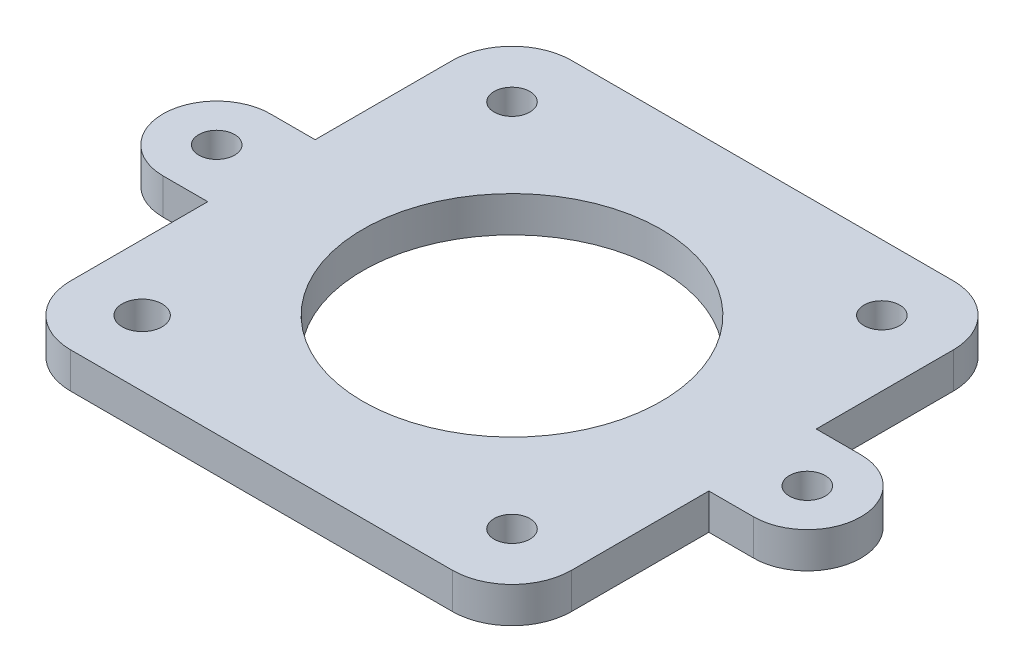
ISO-10303-21;
HEADER;
FILE_DESCRIPTION(('STEP AP214'),'2;1');
FILE_NAME('part.step','',(''),(''),'','','');
FILE_SCHEMA(('AUTOMOTIVE_DESIGN { 1 0 10303 214 1 1 1 1 }'));
ENDSEC;
DATA;
#1=APPLICATION_CONTEXT('core data for automotive mechanical design processes');
#2=APPLICATION_PROTOCOL_DEFINITION('international standard','automotive_design',2000,#1);
#3=PRODUCT_CONTEXT('',#1,'mechanical');
#4=PRODUCT('Part','Part','',(#3));
#5=PRODUCT_RELATED_PRODUCT_CATEGORY('part','',(#4));
#6=PRODUCT_DEFINITION_FORMATION('','',#4);
#7=PRODUCT_DEFINITION_CONTEXT('part definition',#1,'design');
#8=PRODUCT_DEFINITION('design','',#6,#7);
#9=PRODUCT_DEFINITION_SHAPE('','',#8);
#10=(LENGTH_UNIT() NAMED_UNIT(*) SI_UNIT(.MILLI.,.METRE.));
#11=(NAMED_UNIT(*) PLANE_ANGLE_UNIT() SI_UNIT($,.RADIAN.));
#12=(NAMED_UNIT(*) SI_UNIT($,.STERADIAN.) SOLID_ANGLE_UNIT());
#13=UNCERTAINTY_MEASURE_WITH_UNIT(LENGTH_MEASURE(1.E-05),#10,'distance_accuracy_value','');
#14=(GEOMETRIC_REPRESENTATION_CONTEXT(3) GLOBAL_UNCERTAINTY_ASSIGNED_CONTEXT((#13)) GLOBAL_UNIT_ASSIGNED_CONTEXT((#10,
#11,#12)) REPRESENTATION_CONTEXT('',''));
#15=CARTESIAN_POINT('',(0.,0.,0.));
#16=DIRECTION('',(0.,0.,1.));
#17=DIRECTION('',(1.,0.,0.));
#18=AXIS2_PLACEMENT_3D('',#15,#16,#17);
#19=CARTESIAN_POINT('',(21.,3.,16.));
#20=DIRECTION('',(-1.,0.,0.));
#21=DIRECTION('',(0.,0.,1.));
#22=AXIS2_PLACEMENT_3D('',#19,#20,#21);
#23=PLANE('',#22);
#24=DIRECTION('',(0.,0.,-1.));
#25=VECTOR('',#24,1.);
#26=CARTESIAN_POINT('',(21.,0.,16.));
#27=LINE('',#26,#25);
#28=CARTESIAN_POINT('',(21.,0.,16.));
#29=VERTEX_POINT('',#28);
#30=CARTESIAN_POINT('',(21.,0.,4.5));
#31=VERTEX_POINT('',#30);
#32=EDGE_CURVE('E277',#29,#31,#27,.T.);
#33=ORIENTED_EDGE('',*,*,#32,.T.);
#34=DIRECTION('',(0.,1.,0.));
#35=VECTOR('',#34,1.);
#36=CARTESIAN_POINT('',(21.,0.,4.5));
#37=LINE('',#36,#35);
#38=CARTESIAN_POINT('',(21.,3.,4.5));
#39=VERTEX_POINT('',#38);
#40=EDGE_CURVE('E185',#31,#39,#37,.T.);
#41=ORIENTED_EDGE('',*,*,#40,.T.);
#42=DIRECTION('',(0.,0.,-1.));
#43=VECTOR('',#42,1.);
#44=CARTESIAN_POINT('',(21.,3.,16.));
#45=LINE('',#44,#43);
#46=CARTESIAN_POINT('',(21.,3.,16.));
#47=VERTEX_POINT('',#46);
#48=EDGE_CURVE('E257',#47,#39,#45,.T.);
#49=ORIENTED_EDGE('',*,*,#48,.F.);
#50=DIRECTION('',(0.,-1.,0.));
#51=VECTOR('',#50,1.);
#52=CARTESIAN_POINT('',(21.,3.,16.));
#53=LINE('',#52,#51);
#54=EDGE_CURVE('E303',#47,#29,#53,.T.);
#55=ORIENTED_EDGE('',*,*,#54,.T.);
#56=EDGE_LOOP('',(#33,#41,#49,#55));
#57=FACE_BOUND('',#56,.T.);
#58=ADVANCED_FACE('F33',(#57),#23,.F.);
#59=CARTESIAN_POINT('',(-21.,3.,16.));
#60=DIRECTION('',(1.,0.,0.));
#61=DIRECTION('',(0.,0.,-1.));
#62=AXIS2_PLACEMENT_3D('',#59,#60,#61);
#63=PLANE('',#62);
#64=DIRECTION('',(0.,0.,1.));
#65=VECTOR('',#64,1.);
#66=CARTESIAN_POINT('',(-21.,0.,16.));
#67=LINE('',#66,#65);
#68=CARTESIAN_POINT('',(-21.,0.,-16.));
#69=VERTEX_POINT('',#68);
#70=CARTESIAN_POINT('',(-21.,0.,-4.5));
#71=VERTEX_POINT('',#70);
#72=EDGE_CURVE('E252',#69,#71,#67,.T.);
#73=ORIENTED_EDGE('',*,*,#72,.T.);
#74=DIRECTION('',(0.,1.,0.));
#75=VECTOR('',#74,1.);
#76=CARTESIAN_POINT('',(-21.,0.,-4.5));
#77=LINE('',#76,#75);
#78=CARTESIAN_POINT('',(-21.,3.,-4.5));
#79=VERTEX_POINT('',#78);
#80=EDGE_CURVE('E212',#71,#79,#77,.T.);
#81=ORIENTED_EDGE('',*,*,#80,.T.);
#82=DIRECTION('',(0.,0.,1.));
#83=VECTOR('',#82,1.);
#84=CARTESIAN_POINT('',(-21.,3.,16.));
#85=LINE('',#84,#83);
#86=CARTESIAN_POINT('',(-21.,3.,-16.));
#87=VERTEX_POINT('',#86);
#88=EDGE_CURVE('E267',#87,#79,#85,.T.);
#89=ORIENTED_EDGE('',*,*,#88,.F.);
#90=DIRECTION('',(0.,-1.,0.));
#91=VECTOR('',#90,1.);
#92=CARTESIAN_POINT('',(-21.,3.,-16.));
#93=LINE('',#92,#91);
#94=EDGE_CURVE('E291',#87,#69,#93,.T.);
#95=ORIENTED_EDGE('',*,*,#94,.T.);
#96=EDGE_LOOP('',(#73,#81,#89,#95));
#97=FACE_BOUND('',#96,.T.);
#98=ADVANCED_FACE('F341',(#97),#63,.F.);
#99=CARTESIAN_POINT('',(-16.,3.,16.));
#100=DIRECTION('',(0.,-1.,0.));
#101=DIRECTION('',(0.,0.,-1.));
#102=AXIS2_PLACEMENT_3D('',#99,#100,#101);
#103=PLANE('',#102);
#104=CARTESIAN_POINT('',(0.,3.,0.));
#105=DIRECTION('',(0.,1.,0.));
#106=DIRECTION('',(0.,0.,1.));
#107=AXIS2_PLACEMENT_3D('',#104,#105,#106);
#108=CIRCLE('',#107,12.5);
#109=CARTESIAN_POINT('',(0.,3.,12.5));
#110=VERTEX_POINT('',#109);
#111=EDGE_CURVE('E211',#110,#110,#108,.T.);
#112=ORIENTED_EDGE('',*,*,#111,.F.);
#113=EDGE_LOOP('',(#112));
#114=FACE_BOUND('',#113,.T.);
#115=CARTESIAN_POINT('',(-15.5,3.,-15.5));
#116=DIRECTION('',(0.,1.,0.));
#117=DIRECTION('',(0.,0.,1.));
#118=AXIS2_PLACEMENT_3D('',#115,#116,#117);
#119=CIRCLE('',#118,1.5);
#120=CARTESIAN_POINT('',(-15.5,3.,-14.));
#121=VERTEX_POINT('',#120);
#122=EDGE_CURVE('E230',#121,#121,#119,.T.);
#123=ORIENTED_EDGE('',*,*,#122,.F.);
#124=EDGE_LOOP('',(#123));
#125=FACE_BOUND('',#124,.T.);
#126=CARTESIAN_POINT('',(15.5,3.,-15.5));
#127=DIRECTION('',(0.,1.,0.));
#128=DIRECTION('',(0.,0.,1.));
#129=AXIS2_PLACEMENT_3D('',#126,#127,#128);
#130=CIRCLE('',#129,1.5);
#131=CARTESIAN_POINT('',(15.5,3.,-14.));
#132=VERTEX_POINT('',#131);
#133=EDGE_CURVE('E242',#132,#132,#130,.T.);
#134=ORIENTED_EDGE('',*,*,#133,.F.);
#135=EDGE_LOOP('',(#134));
#136=FACE_BOUND('',#135,.T.);
#137=CARTESIAN_POINT('',(-16.,3.,16.));
#138=DIRECTION('',(0.,1.,0.));
#139=DIRECTION('',(0.,0.,-1.));
#140=AXIS2_PLACEMENT_3D('',#137,#138,#139);
#141=CIRCLE('',#140,5.);
#142=CARTESIAN_POINT('',(-21.,3.,16.));
#143=VERTEX_POINT('',#142);
#144=CARTESIAN_POINT('',(-16.,3.,21.));
#145=VERTEX_POINT('',#144);
#146=EDGE_CURVE('E248',#143,#145,#141,.T.);
#147=ORIENTED_EDGE('',*,*,#146,.T.);
#148=DIRECTION('',(1.,0.,0.));
#149=VECTOR('',#148,1.);
#150=CARTESIAN_POINT('',(-16.,3.,21.));
#151=LINE('',#150,#149);
#152=CARTESIAN_POINT('',(16.,3.,21.));
#153=VERTEX_POINT('',#152);
#154=EDGE_CURVE('E251',#145,#153,#151,.T.);
#155=ORIENTED_EDGE('',*,*,#154,.T.);
#156=CARTESIAN_POINT('',(16.,3.,16.));
#157=DIRECTION('',(0.,1.,0.));
#158=DIRECTION('',(0.,0.,1.));
#159=AXIS2_PLACEMENT_3D('',#156,#157,#158);
#160=CIRCLE('',#159,5.);
#161=EDGE_CURVE('E254',#153,#47,#160,.T.);
#162=ORIENTED_EDGE('',*,*,#161,.T.);
#163=ORIENTED_EDGE('',*,*,#48,.T.);
#164=DIRECTION('',(1.,0.,0.));
#165=VECTOR('',#164,1.);
#166=CARTESIAN_POINT('',(24.75,3.,4.5));
#167=LINE('',#166,#165);
#168=CARTESIAN_POINT('',(24.75,3.,4.5));
#169=VERTEX_POINT('',#168);
#170=EDGE_CURVE('E170',#39,#169,#167,.T.);
#171=ORIENTED_EDGE('',*,*,#170,.T.);
#172=CARTESIAN_POINT('',(24.75,3.,0.));
#173=DIRECTION('',(0.,1.,0.));
#174=DIRECTION('',(0.,0.,1.));
#175=AXIS2_PLACEMENT_3D('',#172,#173,#174);
#176=CIRCLE('',#175,4.5);
#177=CARTESIAN_POINT('',(24.75,3.,-4.5));
#178=VERTEX_POINT('',#177);
#179=EDGE_CURVE('E179',#169,#178,#176,.T.);
#180=ORIENTED_EDGE('',*,*,#179,.T.);
#181=DIRECTION('',(-1.,0.,0.));
#182=VECTOR('',#181,1.);
#183=CARTESIAN_POINT('',(24.75,3.,-4.5));
#184=LINE('',#183,#182);
#185=CARTESIAN_POINT('',(21.,3.,-4.5));
#186=VERTEX_POINT('',#185);
#187=EDGE_CURVE('E48',#178,#186,#184,.T.);
#188=ORIENTED_EDGE('',*,*,#187,.T.);
#189=CARTESIAN_POINT('',(21.,3.,-16.));
#190=VERTEX_POINT('',#189);
#191=EDGE_CURVE('E256',#186,#190,#45,.T.);
#192=ORIENTED_EDGE('',*,*,#191,.T.);
#193=CARTESIAN_POINT('',(16.,3.,-16.));
#194=DIRECTION('',(0.,1.,0.));
#195=DIRECTION('',(0.,0.,-1.));
#196=AXIS2_PLACEMENT_3D('',#193,#194,#195);
#197=CIRCLE('',#196,5.);
#198=CARTESIAN_POINT('',(16.,3.,-21.));
#199=VERTEX_POINT('',#198);
#200=EDGE_CURVE('E260',#190,#199,#197,.T.);
#201=ORIENTED_EDGE('',*,*,#200,.T.);
#202=DIRECTION('',(-1.,0.,0.));
#203=VECTOR('',#202,1.);
#204=CARTESIAN_POINT('',(-16.,3.,-21.));
#205=LINE('',#204,#203);
#206=CARTESIAN_POINT('',(-16.,3.,-21.));
#207=VERTEX_POINT('',#206);
#208=EDGE_CURVE('E262',#199,#207,#205,.T.);
#209=ORIENTED_EDGE('',*,*,#208,.T.);
#210=CARTESIAN_POINT('',(-16.,3.,-16.));
#211=DIRECTION('',(0.,1.,0.));
#212=DIRECTION('',(0.,0.,-1.));
#213=AXIS2_PLACEMENT_3D('',#210,#211,#212);
#214=CIRCLE('',#213,5.);
#215=EDGE_CURVE('E264',#207,#87,#214,.T.);
#216=ORIENTED_EDGE('',*,*,#215,.T.);
#217=ORIENTED_EDGE('',*,*,#88,.T.);
#218=DIRECTION('',(-1.,0.,0.));
#219=VECTOR('',#218,1.);
#220=CARTESIAN_POINT('',(-24.75,3.,-4.5));
#221=LINE('',#220,#219);
#222=CARTESIAN_POINT('',(-24.75,3.,-4.5));
#223=VERTEX_POINT('',#222);
#224=EDGE_CURVE('E199',#79,#223,#221,.T.);
#225=ORIENTED_EDGE('',*,*,#224,.T.);
#226=CARTESIAN_POINT('',(-24.75,3.,0.));
#227=DIRECTION('',(0.,1.,0.));
#228=DIRECTION('',(0.,0.,1.));
#229=AXIS2_PLACEMENT_3D('',#226,#227,#228);
#230=CIRCLE('',#229,4.5);
#231=CARTESIAN_POINT('',(-24.75,3.,4.5));
#232=VERTEX_POINT('',#231);
#233=EDGE_CURVE('E192',#223,#232,#230,.T.);
#234=ORIENTED_EDGE('',*,*,#233,.T.);
#235=DIRECTION('',(1.,0.,0.));
#236=VECTOR('',#235,1.);
#237=CARTESIAN_POINT('',(-24.75,3.,4.5));
#238=LINE('',#237,#236);
#239=CARTESIAN_POINT('',(-21.,3.,4.5));
#240=VERTEX_POINT('',#239);
#241=EDGE_CURVE('E55',#232,#240,#238,.T.);
#242=ORIENTED_EDGE('',*,*,#241,.T.);
#243=EDGE_CURVE('E266',#240,#143,#85,.T.);
#244=ORIENTED_EDGE('',*,*,#243,.T.);
#245=EDGE_LOOP('',(#147,#155,#162,#163,#171,#180,#188,#192,#201,#209,#216,#217,#225,#234,#242,#244));
#246=FACE_BOUND('',#245,.T.);
#247=CARTESIAN_POINT('',(15.5,3.,15.5));
#248=DIRECTION('',(0.,1.,0.));
#249=DIRECTION('',(0.,0.,1.));
#250=AXIS2_PLACEMENT_3D('',#247,#248,#249);
#251=CIRCLE('',#250,1.5);
#252=CARTESIAN_POINT('',(15.5,3.,17.));
#253=VERTEX_POINT('',#252);
#254=EDGE_CURVE('E236',#253,#253,#251,.T.);
#255=ORIENTED_EDGE('',*,*,#254,.F.);
#256=EDGE_LOOP('',(#255));
#257=FACE_BOUND('',#256,.T.);
#258=CARTESIAN_POINT('',(-15.5,3.,15.5));
#259=DIRECTION('',(0.,1.,0.));
#260=DIRECTION('',(0.,0.,1.));
#261=AXIS2_PLACEMENT_3D('',#258,#259,#260);
#262=CIRCLE('',#261,1.67292592504423);
#263=CARTESIAN_POINT('',(-15.5,3.,17.1729259250442));
#264=VERTEX_POINT('',#263);
#265=EDGE_CURVE('E224',#264,#264,#262,.T.);
#266=ORIENTED_EDGE('',*,*,#265,.F.);
#267=EDGE_LOOP('',(#266));
#268=FACE_BOUND('',#267,.T.);
#269=CARTESIAN_POINT('',(-24.75,3.,0.));
#270=DIRECTION('',(0.,1.,0.));
#271=DIRECTION('',(0.,0.,1.));
#272=AXIS2_PLACEMENT_3D('',#269,#270,#271);
#273=CIRCLE('',#272,1.5);
#274=CARTESIAN_POINT('',(-24.75,3.,1.5));
#275=VERTEX_POINT('',#274);
#276=EDGE_CURVE('E184',#275,#275,#273,.T.);
#277=ORIENTED_EDGE('',*,*,#276,.F.);
#278=EDGE_LOOP('',(#277));
#279=FACE_BOUND('',#278,.T.);
#280=CARTESIAN_POINT('',(24.75,3.,0.));
#281=DIRECTION('',(0.,1.,0.));
#282=DIRECTION('',(0.,0.,1.));
#283=AXIS2_PLACEMENT_3D('',#280,#281,#282);
#284=CIRCLE('',#283,1.5);
#285=CARTESIAN_POINT('',(24.75,3.,1.5));
#286=VERTEX_POINT('',#285);
#287=EDGE_CURVE('E175',#286,#286,#284,.T.);
#288=ORIENTED_EDGE('',*,*,#287,.F.);
#289=EDGE_LOOP('',(#288));
#290=FACE_BOUND('',#289,.T.);
#291=ADVANCED_FACE('F316',(#114,#125,#136,#246,#257,#268,#279,#290),#103,.F.);
#292=CARTESIAN_POINT('',(-16.,0.,16.));
#293=DIRECTION('',(0.,-1.,0.));
#294=DIRECTION('',(0.,0.,-1.));
#295=AXIS2_PLACEMENT_3D('',#292,#293,#294);
#296=PLANE('',#295);
#297=CARTESIAN_POINT('',(0.,0.,0.));
#298=DIRECTION('',(0.,1.,0.));
#299=DIRECTION('',(0.,0.,1.));
#300=AXIS2_PLACEMENT_3D('',#297,#298,#299);
#301=CIRCLE('',#300,12.5);
#302=CARTESIAN_POINT('',(0.,0.,12.5));
#303=VERTEX_POINT('',#302);
#304=EDGE_CURVE('E218',#303,#303,#301,.T.);
#305=ORIENTED_EDGE('',*,*,#304,.T.);
#306=EDGE_LOOP('',(#305));
#307=FACE_BOUND('',#306,.T.);
#308=CARTESIAN_POINT('',(-15.5,0.,-15.5));
#309=DIRECTION('',(0.,1.,0.));
#310=DIRECTION('',(0.,0.,1.));
#311=AXIS2_PLACEMENT_3D('',#308,#309,#310);
#312=CIRCLE('',#311,1.5);
#313=CARTESIAN_POINT('',(-15.5,0.,-14.));
#314=VERTEX_POINT('',#313);
#315=EDGE_CURVE('E227',#314,#314,#312,.T.);
#316=ORIENTED_EDGE('',*,*,#315,.T.);
#317=EDGE_LOOP('',(#316));
#318=FACE_BOUND('',#317,.T.);
#319=CARTESIAN_POINT('',(15.5,0.,-15.5));
#320=DIRECTION('',(0.,1.,0.));
#321=DIRECTION('',(0.,0.,1.));
#322=AXIS2_PLACEMENT_3D('',#319,#320,#321);
#323=CIRCLE('',#322,1.5);
#324=CARTESIAN_POINT('',(15.5,0.,-14.));
#325=VERTEX_POINT('',#324);
#326=EDGE_CURVE('E239',#325,#325,#323,.T.);
#327=ORIENTED_EDGE('',*,*,#326,.T.);
#328=EDGE_LOOP('',(#327));
#329=FACE_BOUND('',#328,.T.);
#330=CARTESIAN_POINT('',(-16.,0.,16.));
#331=DIRECTION('',(0.,1.,0.));
#332=DIRECTION('',(0.,0.,-1.));
#333=AXIS2_PLACEMENT_3D('',#330,#331,#332);
#334=CIRCLE('',#333,5.);
#335=CARTESIAN_POINT('',(-21.,0.,16.));
#336=VERTEX_POINT('',#335);
#337=CARTESIAN_POINT('',(-16.,0.,21.));
#338=VERTEX_POINT('',#337);
#339=EDGE_CURVE('E245',#336,#338,#334,.T.);
#340=ORIENTED_EDGE('',*,*,#339,.F.);
#341=CARTESIAN_POINT('',(-21.,0.,4.5));
#342=VERTEX_POINT('',#341);
#343=EDGE_CURVE('E286',#342,#336,#67,.T.);
#344=ORIENTED_EDGE('',*,*,#343,.F.);
#345=DIRECTION('',(1.,0.,0.));
#346=VECTOR('',#345,1.);
#347=CARTESIAN_POINT('',(-24.75,0.,4.5));
#348=LINE('',#347,#346);
#349=CARTESIAN_POINT('',(-24.75,0.,4.5));
#350=VERTEX_POINT('',#349);
#351=EDGE_CURVE('E198',#350,#342,#348,.T.);
#352=ORIENTED_EDGE('',*,*,#351,.F.);
#353=CARTESIAN_POINT('',(-24.75,0.,0.));
#354=DIRECTION('',(0.,1.,0.));
#355=DIRECTION('',(0.,0.,1.));
#356=AXIS2_PLACEMENT_3D('',#353,#354,#355);
#357=CIRCLE('',#356,4.5);
#358=CARTESIAN_POINT('',(-24.75,0.,-4.5));
#359=VERTEX_POINT('',#358);
#360=EDGE_CURVE('E195',#359,#350,#357,.T.);
#361=ORIENTED_EDGE('',*,*,#360,.F.);
#362=DIRECTION('',(-1.,0.,0.));
#363=VECTOR('',#362,1.);
#364=CARTESIAN_POINT('',(-24.75,0.,-4.5));
#365=LINE('',#364,#363);
#366=EDGE_CURVE('E201',#71,#359,#365,.T.);
#367=ORIENTED_EDGE('',*,*,#366,.F.);
#368=ORIENTED_EDGE('',*,*,#72,.F.);
#369=CARTESIAN_POINT('',(-16.,0.,-16.));
#370=DIRECTION('',(0.,1.,0.));
#371=DIRECTION('',(0.,0.,-1.));
#372=AXIS2_PLACEMENT_3D('',#369,#370,#371);
#373=CIRCLE('',#372,5.);
#374=CARTESIAN_POINT('',(-16.,0.,-21.));
#375=VERTEX_POINT('',#374);
#376=EDGE_CURVE('E284',#375,#69,#373,.T.);
#377=ORIENTED_EDGE('',*,*,#376,.F.);
#378=DIRECTION('',(-1.,0.,0.));
#379=VECTOR('',#378,1.);
#380=CARTESIAN_POINT('',(-16.,0.,-21.));
#381=LINE('',#380,#379);
#382=CARTESIAN_POINT('',(16.,0.,-21.));
#383=VERTEX_POINT('',#382);
#384=EDGE_CURVE('E282',#383,#375,#381,.T.);
#385=ORIENTED_EDGE('',*,*,#384,.F.);
#386=CARTESIAN_POINT('',(16.,0.,-16.));
#387=DIRECTION('',(0.,1.,0.));
#388=DIRECTION('',(0.,0.,-1.));
#389=AXIS2_PLACEMENT_3D('',#386,#387,#388);
#390=CIRCLE('',#389,5.);
#391=CARTESIAN_POINT('',(21.,0.,-16.));
#392=VERTEX_POINT('',#391);
#393=EDGE_CURVE('E280',#392,#383,#390,.T.);
#394=ORIENTED_EDGE('',*,*,#393,.F.);
#395=CARTESIAN_POINT('',(21.,0.,-4.5));
#396=VERTEX_POINT('',#395);
#397=EDGE_CURVE('E166',#396,#392,#27,.T.);
#398=ORIENTED_EDGE('',*,*,#397,.F.);
#399=DIRECTION('',(-1.,0.,0.));
#400=VECTOR('',#399,1.);
#401=CARTESIAN_POINT('',(24.75,0.,-4.5));
#402=LINE('',#401,#400);
#403=CARTESIAN_POINT('',(24.75,0.,-4.5));
#404=VERTEX_POINT('',#403);
#405=EDGE_CURVE('E148',#404,#396,#402,.T.);
#406=ORIENTED_EDGE('',*,*,#405,.F.);
#407=CARTESIAN_POINT('',(24.75,0.,0.));
#408=DIRECTION('',(0.,1.,0.));
#409=DIRECTION('',(0.,0.,1.));
#410=AXIS2_PLACEMENT_3D('',#407,#408,#409);
#411=CIRCLE('',#410,4.5);
#412=CARTESIAN_POINT('',(24.75,0.,4.5));
#413=VERTEX_POINT('',#412);
#414=EDGE_CURVE('E163',#413,#404,#411,.T.);
#415=ORIENTED_EDGE('',*,*,#414,.F.);
#416=DIRECTION('',(1.,0.,0.));
#417=VECTOR('',#416,1.);
#418=CARTESIAN_POINT('',(24.75,0.,4.5));
#419=LINE('',#418,#417);
#420=EDGE_CURVE('E154',#31,#413,#419,.T.);
#421=ORIENTED_EDGE('',*,*,#420,.F.);
#422=ORIENTED_EDGE('',*,*,#32,.F.);
#423=CARTESIAN_POINT('',(16.,0.,16.));
#424=DIRECTION('',(0.,1.,0.));
#425=DIRECTION('',(0.,0.,1.));
#426=AXIS2_PLACEMENT_3D('',#423,#424,#425);
#427=CIRCLE('',#426,5.);
#428=CARTESIAN_POINT('',(16.,0.,21.));
#429=VERTEX_POINT('',#428);
#430=EDGE_CURVE('E275',#429,#29,#427,.T.);
#431=ORIENTED_EDGE('',*,*,#430,.F.);
#432=DIRECTION('',(1.,0.,0.));
#433=VECTOR('',#432,1.);
#434=CARTESIAN_POINT('',(-16.,0.,21.));
#435=LINE('',#434,#433);
#436=EDGE_CURVE('E273',#338,#429,#435,.T.);
#437=ORIENTED_EDGE('',*,*,#436,.F.);
#438=EDGE_LOOP('',(#340,#344,#352,#361,#367,#368,#377,#385,#394,#398,#406,#415,#421,#422,#431,#437));
#439=FACE_BOUND('',#438,.T.);
#440=CARTESIAN_POINT('',(15.5,0.,15.5));
#441=DIRECTION('',(0.,1.,0.));
#442=DIRECTION('',(0.,0.,1.));
#443=AXIS2_PLACEMENT_3D('',#440,#441,#442);
#444=CIRCLE('',#443,1.5);
#445=CARTESIAN_POINT('',(15.5,0.,17.));
#446=VERTEX_POINT('',#445);
#447=EDGE_CURVE('E233',#446,#446,#444,.T.);
#448=ORIENTED_EDGE('',*,*,#447,.T.);
#449=EDGE_LOOP('',(#448));
#450=FACE_BOUND('',#449,.T.);
#451=CARTESIAN_POINT('',(-15.5,0.,15.5));
#452=DIRECTION('',(0.,1.,0.));
#453=DIRECTION('',(0.,0.,1.));
#454=AXIS2_PLACEMENT_3D('',#451,#452,#453);
#455=CIRCLE('',#454,1.67292592504423);
#456=CARTESIAN_POINT('',(-15.5,0.,17.1729259250442));
#457=VERTEX_POINT('',#456);
#458=EDGE_CURVE('E221',#457,#457,#455,.T.);
#459=ORIENTED_EDGE('',*,*,#458,.T.);
#460=EDGE_LOOP('',(#459));
#461=FACE_BOUND('',#460,.T.);
#462=CARTESIAN_POINT('',(-24.75,0.,0.));
#463=DIRECTION('',(0.,1.,0.));
#464=DIRECTION('',(0.,0.,1.));
#465=AXIS2_PLACEMENT_3D('',#462,#463,#464);
#466=CIRCLE('',#465,1.5);
#467=CARTESIAN_POINT('',(-24.75,0.,1.5));
#468=VERTEX_POINT('',#467);
#469=EDGE_CURVE('E189',#468,#468,#466,.T.);
#470=ORIENTED_EDGE('',*,*,#469,.T.);
#471=EDGE_LOOP('',(#470));
#472=FACE_BOUND('',#471,.T.);
#473=CARTESIAN_POINT('',(24.75,0.,0.));
#474=DIRECTION('',(0.,1.,0.));
#475=DIRECTION('',(0.,0.,1.));
#476=AXIS2_PLACEMENT_3D('',#473,#474,#475);
#477=CIRCLE('',#476,1.5);
#478=CARTESIAN_POINT('',(24.75,0.,1.5));
#479=VERTEX_POINT('',#478);
#480=EDGE_CURVE('E181',#479,#479,#477,.T.);
#481=ORIENTED_EDGE('',*,*,#480,.T.);
#482=EDGE_LOOP('',(#481));
#483=FACE_BOUND('',#482,.T.);
#484=ADVANCED_FACE('F160',(#307,#318,#329,#439,#450,#461,#472,#483),#296,.T.);
#485=CARTESIAN_POINT('',(-16.,3.,16.));
#486=DIRECTION('',(0.,-1.,0.));
#487=DIRECTION('',(0.,0.,-1.));
#488=AXIS2_PLACEMENT_3D('',#485,#486,#487);
#489=CYLINDRICAL_SURFACE('',#488,5.);
#490=ORIENTED_EDGE('',*,*,#339,.T.);
#491=DIRECTION('',(0.,-1.,0.));
#492=VECTOR('',#491,1.);
#493=CARTESIAN_POINT('',(-16.,3.,21.));
#494=LINE('',#493,#492);
#495=EDGE_CURVE('E11',#145,#338,#494,.T.);
#496=ORIENTED_EDGE('',*,*,#495,.F.);
#497=ORIENTED_EDGE('',*,*,#146,.F.);
#498=DIRECTION('',(0.,-1.,0.));
#499=VECTOR('',#498,1.);
#500=CARTESIAN_POINT('',(-21.,3.,16.));
#501=LINE('',#500,#499);
#502=EDGE_CURVE('E270',#143,#336,#501,.T.);
#503=ORIENTED_EDGE('',*,*,#502,.T.);
#504=EDGE_LOOP('',(#490,#496,#497,#503));
#505=FACE_BOUND('',#504,.T.);
#506=ADVANCED_FACE('F35',(#505),#489,.T.);
#507=CARTESIAN_POINT('',(-16.,3.,21.));
#508=DIRECTION('',(0.,0.,-1.));
#509=DIRECTION('',(-1.,0.,0.));
#510=AXIS2_PLACEMENT_3D('',#507,#508,#509);
#511=PLANE('',#510);
#512=ORIENTED_EDGE('',*,*,#436,.T.);
#513=DIRECTION('',(0.,-1.,0.));
#514=VECTOR('',#513,1.);
#515=CARTESIAN_POINT('',(16.,3.,21.));
#516=LINE('',#515,#514);
#517=EDGE_CURVE('E41',#153,#429,#516,.T.);
#518=ORIENTED_EDGE('',*,*,#517,.F.);
#519=ORIENTED_EDGE('',*,*,#154,.F.);
#520=ORIENTED_EDGE('',*,*,#495,.T.);
#521=EDGE_LOOP('',(#512,#518,#519,#520));
#522=FACE_BOUND('',#521,.T.);
#523=ADVANCED_FACE('F320',(#522),#511,.F.);
#524=CARTESIAN_POINT('',(16.,3.,16.));
#525=DIRECTION('',(0.,-1.,0.));
#526=DIRECTION('',(0.,0.,-1.));
#527=AXIS2_PLACEMENT_3D('',#524,#525,#526);
#528=CYLINDRICAL_SURFACE('',#527,5.);
#529=ORIENTED_EDGE('',*,*,#430,.T.);
#530=ORIENTED_EDGE('',*,*,#54,.F.);
#531=ORIENTED_EDGE('',*,*,#161,.F.);
#532=ORIENTED_EDGE('',*,*,#517,.T.);
#533=EDGE_LOOP('',(#529,#530,#531,#532));
#534=FACE_BOUND('',#533,.T.);
#535=ADVANCED_FACE('F310',(#534),#528,.T.);
#536=ORIENTED_EDGE('',*,*,#191,.F.);
#537=DIRECTION('',(0.,1.,0.));
#538=VECTOR('',#537,1.);
#539=CARTESIAN_POINT('',(21.,0.,-4.5));
#540=LINE('',#539,#538);
#541=EDGE_CURVE('E153',#396,#186,#540,.T.);
#542=ORIENTED_EDGE('',*,*,#541,.F.);
#543=ORIENTED_EDGE('',*,*,#397,.T.);
#544=DIRECTION('',(0.,-1.,0.));
#545=VECTOR('',#544,1.);
#546=CARTESIAN_POINT('',(21.,3.,-16.));
#547=LINE('',#546,#545);
#548=EDGE_CURVE('E300',#190,#392,#547,.T.);
#549=ORIENTED_EDGE('',*,*,#548,.F.);
#550=EDGE_LOOP('',(#536,#542,#543,#549));
#551=FACE_BOUND('',#550,.T.);
#552=ADVANCED_FACE('F359',(#551),#23,.F.);
#553=CARTESIAN_POINT('',(16.,3.,-16.));
#554=DIRECTION('',(0.,-1.,0.));
#555=DIRECTION('',(0.,0.,-1.));
#556=AXIS2_PLACEMENT_3D('',#553,#554,#555);
#557=CYLINDRICAL_SURFACE('',#556,5.);
#558=ORIENTED_EDGE('',*,*,#393,.T.);
#559=DIRECTION('',(0.,-1.,0.));
#560=VECTOR('',#559,1.);
#561=CARTESIAN_POINT('',(16.,3.,-21.));
#562=LINE('',#561,#560);
#563=EDGE_CURVE('E297',#199,#383,#562,.T.);
#564=ORIENTED_EDGE('',*,*,#563,.F.);
#565=ORIENTED_EDGE('',*,*,#200,.F.);
#566=ORIENTED_EDGE('',*,*,#548,.T.);
#567=EDGE_LOOP('',(#558,#564,#565,#566));
#568=FACE_BOUND('',#567,.T.);
#569=ADVANCED_FACE('F355',(#568),#557,.T.);
#570=CARTESIAN_POINT('',(-16.,3.,-21.));
#571=DIRECTION('',(0.,0.,1.));
#572=DIRECTION('',(1.,0.,0.));
#573=AXIS2_PLACEMENT_3D('',#570,#571,#572);
#574=PLANE('',#573);
#575=ORIENTED_EDGE('',*,*,#384,.T.);
#576=DIRECTION('',(0.,-1.,0.));
#577=VECTOR('',#576,1.);
#578=CARTESIAN_POINT('',(-16.,3.,-21.));
#579=LINE('',#578,#577);
#580=EDGE_CURVE('E294',#207,#375,#579,.T.);
#581=ORIENTED_EDGE('',*,*,#580,.F.);
#582=ORIENTED_EDGE('',*,*,#208,.F.);
#583=ORIENTED_EDGE('',*,*,#563,.T.);
#584=EDGE_LOOP('',(#575,#581,#582,#583));
#585=FACE_BOUND('',#584,.T.);
#586=ADVANCED_FACE('F351',(#585),#574,.F.);
#587=CARTESIAN_POINT('',(-16.,3.,-16.));
#588=DIRECTION('',(0.,-1.,0.));
#589=DIRECTION('',(0.,0.,-1.));
#590=AXIS2_PLACEMENT_3D('',#587,#588,#589);
#591=CYLINDRICAL_SURFACE('',#590,5.);
#592=ORIENTED_EDGE('',*,*,#376,.T.);
#593=ORIENTED_EDGE('',*,*,#94,.F.);
#594=ORIENTED_EDGE('',*,*,#215,.F.);
#595=ORIENTED_EDGE('',*,*,#580,.T.);
#596=EDGE_LOOP('',(#592,#593,#594,#595));
#597=FACE_BOUND('',#596,.T.);
#598=ADVANCED_FACE('F347',(#597),#591,.T.);
#599=ORIENTED_EDGE('',*,*,#243,.F.);
#600=DIRECTION('',(0.,1.,0.));
#601=VECTOR('',#600,1.);
#602=CARTESIAN_POINT('',(-21.,0.,4.5));
#603=LINE('',#602,#601);
#604=EDGE_CURVE('E215',#342,#240,#603,.T.);
#605=ORIENTED_EDGE('',*,*,#604,.F.);
#606=ORIENTED_EDGE('',*,*,#343,.T.);
#607=ORIENTED_EDGE('',*,*,#502,.F.);
#608=EDGE_LOOP('',(#599,#605,#606,#607));
#609=FACE_BOUND('',#608,.T.);
#610=ADVANCED_FACE('F329',(#609),#63,.F.);
#611=CARTESIAN_POINT('',(15.5,3.,-15.5));
#612=DIRECTION('',(0.,-1.,0.));
#613=DIRECTION('',(0.,0.,-1.));
#614=AXIS2_PLACEMENT_3D('',#611,#612,#613);
#615=CYLINDRICAL_SURFACE('',#614,1.5);
#616=ORIENTED_EDGE('',*,*,#133,.T.);
#617=EDGE_LOOP('',(#616));
#618=FACE_BOUND('',#617,.T.);
#619=ORIENTED_EDGE('',*,*,#326,.F.);
#620=EDGE_LOOP('',(#619));
#621=FACE_BOUND('',#620,.T.);
#622=ADVANCED_FACE('F381',(#618,#621),#615,.F.);
#623=CARTESIAN_POINT('',(15.5,3.,15.5));
#624=DIRECTION('',(0.,-1.,0.));
#625=DIRECTION('',(0.,0.,-1.));
#626=AXIS2_PLACEMENT_3D('',#623,#624,#625);
#627=CYLINDRICAL_SURFACE('',#626,1.5);
#628=ORIENTED_EDGE('',*,*,#254,.T.);
#629=EDGE_LOOP('',(#628));
#630=FACE_BOUND('',#629,.T.);
#631=ORIENTED_EDGE('',*,*,#447,.F.);
#632=EDGE_LOOP('',(#631));
#633=FACE_BOUND('',#632,.T.);
#634=ADVANCED_FACE('F386',(#630,#633),#627,.F.);
#635=CARTESIAN_POINT('',(-15.5,3.,-15.5));
#636=DIRECTION('',(0.,-1.,0.));
#637=DIRECTION('',(0.,0.,-1.));
#638=AXIS2_PLACEMENT_3D('',#635,#636,#637);
#639=CYLINDRICAL_SURFACE('',#638,1.5);
#640=ORIENTED_EDGE('',*,*,#122,.T.);
#641=EDGE_LOOP('',(#640));
#642=FACE_BOUND('',#641,.T.);
#643=ORIENTED_EDGE('',*,*,#315,.F.);
#644=EDGE_LOOP('',(#643));
#645=FACE_BOUND('',#644,.T.);
#646=ADVANCED_FACE('F464',(#642,#645),#639,.F.);
#647=CARTESIAN_POINT('',(-15.5,3.,15.5));
#648=DIRECTION('',(0.,-1.,0.));
#649=DIRECTION('',(0.,0.,-1.));
#650=AXIS2_PLACEMENT_3D('',#647,#648,#649);
#651=CYLINDRICAL_SURFACE('',#650,1.67292592504423);
#652=ORIENTED_EDGE('',*,*,#265,.T.);
#653=EDGE_LOOP('',(#652));
#654=FACE_BOUND('',#653,.T.);
#655=ORIENTED_EDGE('',*,*,#458,.F.);
#656=EDGE_LOOP('',(#655));
#657=FACE_BOUND('',#656,.T.);
#658=ADVANCED_FACE('F453',(#654,#657),#651,.F.);
#659=CARTESIAN_POINT('',(0.,0.,0.));
#660=DIRECTION('',(0.,1.,0.));
#661=DIRECTION('',(0.,0.,1.));
#662=AXIS2_PLACEMENT_3D('',#659,#660,#661);
#663=CYLINDRICAL_SURFACE('',#662,12.5);
#664=ORIENTED_EDGE('',*,*,#304,.F.);
#665=EDGE_LOOP('',(#664));
#666=FACE_BOUND('',#665,.T.);
#667=ORIENTED_EDGE('',*,*,#111,.T.);
#668=EDGE_LOOP('',(#667));
#669=FACE_BOUND('',#668,.T.);
#670=ADVANCED_FACE('F449',(#666,#669),#663,.F.);
#671=CARTESIAN_POINT('',(-24.75,0.,0.));
#672=DIRECTION('',(0.,1.,0.));
#673=DIRECTION('',(0.,0.,1.));
#674=AXIS2_PLACEMENT_3D('',#671,#672,#673);
#675=CYLINDRICAL_SURFACE('',#674,4.5);
#676=ORIENTED_EDGE('',*,*,#233,.F.);
#677=DIRECTION('',(0.,1.,0.));
#678=VECTOR('',#677,1.);
#679=CARTESIAN_POINT('',(-24.75,0.,-4.5));
#680=LINE('',#679,#678);
#681=EDGE_CURVE('E209',#359,#223,#680,.T.);
#682=ORIENTED_EDGE('',*,*,#681,.F.);
#683=ORIENTED_EDGE('',*,*,#360,.T.);
#684=DIRECTION('',(0.,1.,0.));
#685=VECTOR('',#684,1.);
#686=CARTESIAN_POINT('',(-24.75,0.,4.5));
#687=LINE('',#686,#685);
#688=EDGE_CURVE('E204',#350,#232,#687,.T.);
#689=ORIENTED_EDGE('',*,*,#688,.T.);
#690=EDGE_LOOP('',(#676,#682,#683,#689));
#691=FACE_BOUND('',#690,.T.);
#692=ADVANCED_FACE('F334',(#691),#675,.T.);
#693=CARTESIAN_POINT('',(-24.75,0.,-4.5));
#694=DIRECTION('',(0.,0.,-1.));
#695=DIRECTION('',(-1.,0.,0.));
#696=AXIS2_PLACEMENT_3D('',#693,#694,#695);
#697=PLANE('',#696);
#698=ORIENTED_EDGE('',*,*,#224,.F.);
#699=ORIENTED_EDGE('',*,*,#80,.F.);
#700=ORIENTED_EDGE('',*,*,#366,.T.);
#701=ORIENTED_EDGE('',*,*,#681,.T.);
#702=EDGE_LOOP('',(#698,#699,#700,#701));
#703=FACE_BOUND('',#702,.T.);
#704=ADVANCED_FACE('F338',(#703),#697,.T.);
#705=CARTESIAN_POINT('',(-24.75,0.,4.5));
#706=DIRECTION('',(0.,0.,1.));
#707=DIRECTION('',(1.,0.,0.));
#708=AXIS2_PLACEMENT_3D('',#705,#706,#707);
#709=PLANE('',#708);
#710=ORIENTED_EDGE('',*,*,#241,.F.);
#711=ORIENTED_EDGE('',*,*,#688,.F.);
#712=ORIENTED_EDGE('',*,*,#351,.T.);
#713=ORIENTED_EDGE('',*,*,#604,.T.);
#714=EDGE_LOOP('',(#710,#711,#712,#713));
#715=FACE_BOUND('',#714,.T.);
#716=ADVANCED_FACE('F331',(#715),#709,.T.);
#717=CARTESIAN_POINT('',(-24.75,0.,0.));
#718=DIRECTION('',(0.,1.,0.));
#719=DIRECTION('',(0.,0.,1.));
#720=AXIS2_PLACEMENT_3D('',#717,#718,#719);
#721=CYLINDRICAL_SURFACE('',#720,1.5);
#722=ORIENTED_EDGE('',*,*,#469,.F.);
#723=EDGE_LOOP('',(#722));
#724=FACE_BOUND('',#723,.T.);
#725=ORIENTED_EDGE('',*,*,#276,.T.);
#726=EDGE_LOOP('',(#725));
#727=FACE_BOUND('',#726,.T.);
#728=ADVANCED_FACE('F524',(#724,#727),#721,.F.);
#729=CARTESIAN_POINT('',(24.75,0.,0.));
#730=DIRECTION('',(0.,1.,0.));
#731=DIRECTION('',(0.,0.,1.));
#732=AXIS2_PLACEMENT_3D('',#729,#730,#731);
#733=CYLINDRICAL_SURFACE('',#732,4.5);
#734=ORIENTED_EDGE('',*,*,#179,.F.);
#735=DIRECTION('',(0.,1.,0.));
#736=VECTOR('',#735,1.);
#737=CARTESIAN_POINT('',(24.75,0.,4.5));
#738=LINE('',#737,#736);
#739=EDGE_CURVE('E169',#413,#169,#738,.T.);
#740=ORIENTED_EDGE('',*,*,#739,.F.);
#741=ORIENTED_EDGE('',*,*,#414,.T.);
#742=DIRECTION('',(0.,1.,0.));
#743=VECTOR('',#742,1.);
#744=CARTESIAN_POINT('',(24.75,0.,-4.5));
#745=LINE('',#744,#743);
#746=EDGE_CURVE('E145',#404,#178,#745,.T.);
#747=ORIENTED_EDGE('',*,*,#746,.T.);
#748=EDGE_LOOP('',(#734,#740,#741,#747));
#749=FACE_BOUND('',#748,.T.);
#750=ADVANCED_FACE('F168',(#749),#733,.T.);
#751=CARTESIAN_POINT('',(24.75,0.,4.5));
#752=DIRECTION('',(0.,0.,1.));
#753=DIRECTION('',(1.,0.,0.));
#754=AXIS2_PLACEMENT_3D('',#751,#752,#753);
#755=PLANE('',#754);
#756=ORIENTED_EDGE('',*,*,#170,.F.);
#757=ORIENTED_EDGE('',*,*,#40,.F.);
#758=ORIENTED_EDGE('',*,*,#420,.T.);
#759=ORIENTED_EDGE('',*,*,#739,.T.);
#760=EDGE_LOOP('',(#756,#757,#758,#759));
#761=FACE_BOUND('',#760,.T.);
#762=ADVANCED_FACE('F542',(#761),#755,.T.);
#763=CARTESIAN_POINT('',(24.75,0.,-4.5));
#764=DIRECTION('',(0.,0.,-1.));
#765=DIRECTION('',(-1.,0.,0.));
#766=AXIS2_PLACEMENT_3D('',#763,#764,#765);
#767=PLANE('',#766);
#768=ORIENTED_EDGE('',*,*,#187,.F.);
#769=ORIENTED_EDGE('',*,*,#746,.F.);
#770=ORIENTED_EDGE('',*,*,#405,.T.);
#771=ORIENTED_EDGE('',*,*,#541,.T.);
#772=EDGE_LOOP('',(#768,#769,#770,#771));
#773=FACE_BOUND('',#772,.T.);
#774=ADVANCED_FACE('F147',(#773),#767,.T.);
#775=CARTESIAN_POINT('',(24.75,0.,0.));
#776=DIRECTION('',(0.,1.,0.));
#777=DIRECTION('',(0.,0.,1.));
#778=AXIS2_PLACEMENT_3D('',#775,#776,#777);
#779=CYLINDRICAL_SURFACE('',#778,1.5);
#780=ORIENTED_EDGE('',*,*,#480,.F.);
#781=EDGE_LOOP('',(#780));
#782=FACE_BOUND('',#781,.T.);
#783=ORIENTED_EDGE('',*,*,#287,.T.);
#784=EDGE_LOOP('',(#783));
#785=FACE_BOUND('',#784,.T.);
#786=ADVANCED_FACE('F560',(#782,#785),#779,.F.);
#787=CLOSED_SHELL('',(#58,#98,#291,#484,#506,#523,#535,#552,#569,#586,#598,#610,#622,#634,#646,
#658,#670,#692,#704,#716,#728,#750,#762,#774,#786));
#788=MANIFOLD_SOLID_BREP('B2',#787);
#789=ADVANCED_BREP_SHAPE_REPRESENTATION('',(#18,#788),#14);
#790=SHAPE_DEFINITION_REPRESENTATION(#9,#789);
ENDSEC;
END-ISO-10303-21;
